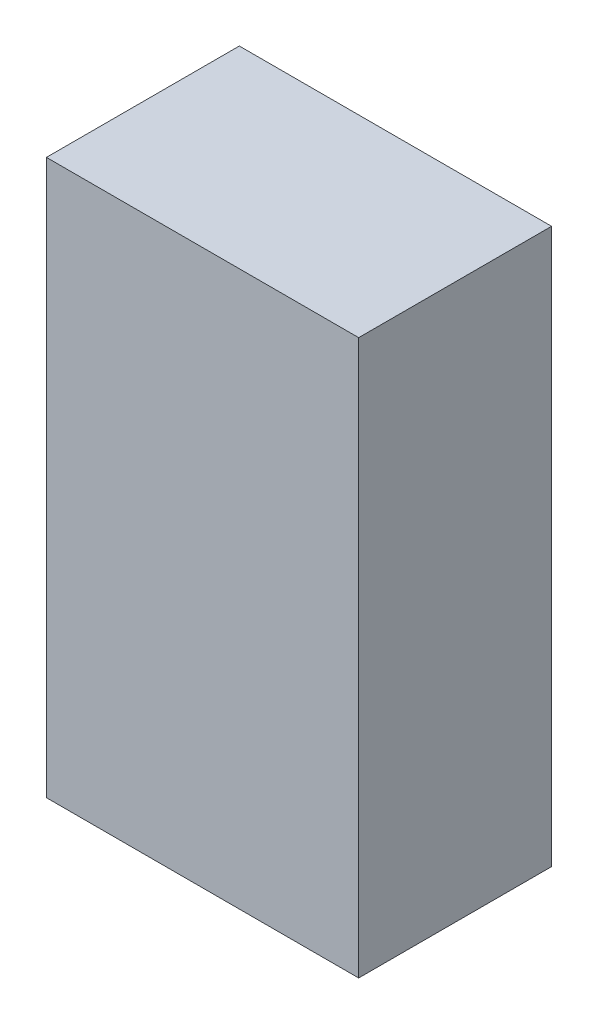
ISO-10303-21;
HEADER;
FILE_DESCRIPTION(('STEP AP214'),'2;1');
FILE_NAME('part.step','',(''),(''),'','','');
FILE_SCHEMA(('AUTOMOTIVE_DESIGN { 1 0 10303 214 1 1 1 1 }'));
ENDSEC;
DATA;
#1=APPLICATION_CONTEXT('core data for automotive mechanical design processes');
#2=APPLICATION_PROTOCOL_DEFINITION('international standard','automotive_design',2000,#1);
#3=PRODUCT_CONTEXT('',#1,'mechanical');
#4=PRODUCT('Part','Part','',(#3));
#5=PRODUCT_RELATED_PRODUCT_CATEGORY('part','',(#4));
#6=PRODUCT_DEFINITION_FORMATION('','',#4);
#7=PRODUCT_DEFINITION_CONTEXT('part definition',#1,'design');
#8=PRODUCT_DEFINITION('design','',#6,#7);
#9=PRODUCT_DEFINITION_SHAPE('','',#8);
#10=(LENGTH_UNIT() NAMED_UNIT(*) SI_UNIT(.MILLI.,.METRE.));
#11=(NAMED_UNIT(*) PLANE_ANGLE_UNIT() SI_UNIT($,.RADIAN.));
#12=(NAMED_UNIT(*) SI_UNIT($,.STERADIAN.) SOLID_ANGLE_UNIT());
#13=UNCERTAINTY_MEASURE_WITH_UNIT(LENGTH_MEASURE(1.E-05),#10,'distance_accuracy_value','');
#14=(GEOMETRIC_REPRESENTATION_CONTEXT(3) GLOBAL_UNCERTAINTY_ASSIGNED_CONTEXT((#13)) GLOBAL_UNIT_ASSIGNED_CONTEXT((#10,
#11,#12)) REPRESENTATION_CONTEXT('',''));
#15=CARTESIAN_POINT('',(0.,0.,0.));
#16=DIRECTION('',(0.,0.,1.));
#17=DIRECTION('',(1.,0.,0.));
#18=AXIS2_PLACEMENT_3D('',#15,#16,#17);
#19=CARTESIAN_POINT('',(-1.29499868,-2.30000048,1.59999934));
#20=DIRECTION('',(0.,0.,1.));
#21=DIRECTION('',(1.,0.,0.));
#22=AXIS2_PLACEMENT_3D('',#19,#20,#21);
#23=PLANE('',#22);
#24=DIRECTION('',(1.,0.,0.));
#25=VECTOR('',#24,1.);
#26=CARTESIAN_POINT('',(-1.29499868,2.30000048,1.59999934));
#27=LINE('',#26,#25);
#28=CARTESIAN_POINT('',(-1.29499868,2.30000048,1.59999934));
#29=VERTEX_POINT('',#28);
#30=CARTESIAN_POINT('',(1.29500122,2.30000048,1.59999934));
#31=VERTEX_POINT('',#30);
#32=EDGE_CURVE('E53',#29,#31,#27,.T.);
#33=ORIENTED_EDGE('',*,*,#32,.F.);
#34=DIRECTION('',(0.,1.,0.));
#35=VECTOR('',#34,1.);
#36=CARTESIAN_POINT('',(-1.29499868,-2.30000048,1.59999934));
#37=LINE('',#36,#35);
#38=CARTESIAN_POINT('',(-1.29499868,-2.30000048,1.59999934));
#39=VERTEX_POINT('',#38);
#40=EDGE_CURVE('E68',#39,#29,#37,.T.);
#41=ORIENTED_EDGE('',*,*,#40,.F.);
#42=DIRECTION('',(1.,0.,0.));
#43=VECTOR('',#42,1.);
#44=CARTESIAN_POINT('',(1.29500122,-2.30000048,1.59999934));
#45=LINE('',#44,#43);
#46=CARTESIAN_POINT('',(1.29500122,-2.30000048,1.59999934));
#47=VERTEX_POINT('',#46);
#48=EDGE_CURVE('E20',#47,#39,#45,.F.);
#49=ORIENTED_EDGE('',*,*,#48,.F.);
#50=DIRECTION('',(0.,1.,0.));
#51=VECTOR('',#50,1.);
#52=CARTESIAN_POINT('',(1.29500122,2.30000048,1.59999934));
#53=LINE('',#52,#51);
#54=EDGE_CURVE('E58',#31,#47,#53,.F.);
#55=ORIENTED_EDGE('',*,*,#54,.F.);
#56=EDGE_LOOP('',(#33,#41,#49,#55));
#57=FACE_BOUND('',#56,.T.);
#58=ADVANCED_FACE('F17',(#57),#23,.T.);
#59=CARTESIAN_POINT('',(1.29500122,-2.30000048,0.));
#60=DIRECTION('',(0.,-1.,0.));
#61=DIRECTION('',(0.,0.,-1.));
#62=AXIS2_PLACEMENT_3D('',#59,#60,#61);
#63=PLANE('',#62);
#64=DIRECTION('',(0.,0.,1.));
#65=VECTOR('',#64,1.);
#66=CARTESIAN_POINT('',(-1.29499868,-2.30000048,0.));
#67=LINE('',#66,#65);
#68=CARTESIAN_POINT('',(-1.29499868,-2.30000048,0.));
#69=VERTEX_POINT('',#68);
#70=EDGE_CURVE('E79',#69,#39,#67,.T.);
#71=ORIENTED_EDGE('',*,*,#70,.F.);
#72=DIRECTION('',(1.,0.,0.));
#73=VECTOR('',#72,1.);
#74=CARTESIAN_POINT('',(-1.29499868,-2.30000048,0.));
#75=LINE('',#74,#73);
#76=CARTESIAN_POINT('',(1.29500122,-2.30000048,0.));
#77=VERTEX_POINT('',#76);
#78=EDGE_CURVE('E74',#69,#77,#75,.T.);
#79=ORIENTED_EDGE('',*,*,#78,.T.);
#80=DIRECTION('',(0.,0.,-1.));
#81=VECTOR('',#80,1.);
#82=CARTESIAN_POINT('',(1.29500122,-2.30000048,0.));
#83=LINE('',#82,#81);
#84=EDGE_CURVE('E63',#47,#77,#83,.T.);
#85=ORIENTED_EDGE('',*,*,#84,.F.);
#86=ORIENTED_EDGE('',*,*,#48,.T.);
#87=EDGE_LOOP('',(#71,#79,#85,#86));
#88=FACE_BOUND('',#87,.T.);
#89=ADVANCED_FACE('F73',(#88),#63,.T.);
#90=CARTESIAN_POINT('',(1.29500122,2.30000048,0.));
#91=DIRECTION('',(1.,0.,0.));
#92=DIRECTION('',(0.,0.,-1.));
#93=AXIS2_PLACEMENT_3D('',#90,#91,#92);
#94=PLANE('',#93);
#95=ORIENTED_EDGE('',*,*,#84,.T.);
#96=DIRECTION('',(0.,1.,0.));
#97=VECTOR('',#96,1.);
#98=CARTESIAN_POINT('',(1.29500122,-2.30000048,0.));
#99=LINE('',#98,#97);
#100=CARTESIAN_POINT('',(1.29500122,2.30000048,0.));
#101=VERTEX_POINT('',#100);
#102=EDGE_CURVE('E84',#77,#101,#99,.T.);
#103=ORIENTED_EDGE('',*,*,#102,.T.);
#104=DIRECTION('',(0.,0.,1.));
#105=VECTOR('',#104,1.);
#106=CARTESIAN_POINT('',(1.29500122,2.30000048,0.));
#107=LINE('',#106,#105);
#108=EDGE_CURVE('E65',#31,#101,#107,.F.);
#109=ORIENTED_EDGE('',*,*,#108,.F.);
#110=ORIENTED_EDGE('',*,*,#54,.T.);
#111=EDGE_LOOP('',(#95,#103,#109,#110));
#112=FACE_BOUND('',#111,.T.);
#113=ADVANCED_FACE('F60',(#112),#94,.T.);
#114=CARTESIAN_POINT('',(-1.29499868,2.30000048,0.));
#115=DIRECTION('',(0.,1.,0.));
#116=DIRECTION('',(0.,0.,1.));
#117=AXIS2_PLACEMENT_3D('',#114,#115,#116);
#118=PLANE('',#117);
#119=ORIENTED_EDGE('',*,*,#108,.T.);
#120=DIRECTION('',(1.,0.,0.));
#121=VECTOR('',#120,1.);
#122=CARTESIAN_POINT('',(-1.29499868,2.30000048,0.));
#123=LINE('',#122,#121);
#124=CARTESIAN_POINT('',(-1.29499868,2.30000048,0.));
#125=VERTEX_POINT('',#124);
#126=EDGE_CURVE('E26',#101,#125,#123,.F.);
#127=ORIENTED_EDGE('',*,*,#126,.T.);
#128=DIRECTION('',(0.,0.,1.));
#129=VECTOR('',#128,1.);
#130=CARTESIAN_POINT('',(-1.29499868,2.30000048,0.));
#131=LINE('',#130,#129);
#132=EDGE_CURVE('E34',#29,#125,#131,.F.);
#133=ORIENTED_EDGE('',*,*,#132,.F.);
#134=ORIENTED_EDGE('',*,*,#32,.T.);
#135=EDGE_LOOP('',(#119,#127,#133,#134));
#136=FACE_BOUND('',#135,.T.);
#137=ADVANCED_FACE('F88',(#136),#118,.T.);
#138=CARTESIAN_POINT('',(-1.29499868,-2.30000048,0.));
#139=DIRECTION('',(-1.,0.,0.));
#140=DIRECTION('',(0.,0.,1.));
#141=AXIS2_PLACEMENT_3D('',#138,#139,#140);
#142=PLANE('',#141);
#143=ORIENTED_EDGE('',*,*,#132,.T.);
#144=DIRECTION('',(0.,1.,0.));
#145=VECTOR('',#144,1.);
#146=CARTESIAN_POINT('',(-1.29499868,-2.30000048,0.));
#147=LINE('',#146,#145);
#148=EDGE_CURVE('E11',#125,#69,#147,.F.);
#149=ORIENTED_EDGE('',*,*,#148,.T.);
#150=ORIENTED_EDGE('',*,*,#70,.T.);
#151=ORIENTED_EDGE('',*,*,#40,.T.);
#152=EDGE_LOOP('',(#143,#149,#150,#151));
#153=FACE_BOUND('',#152,.T.);
#154=ADVANCED_FACE('F91',(#153),#142,.T.);
#155=CARTESIAN_POINT('',(-1.29499868,-2.30000048,0.));
#156=DIRECTION('',(0.,0.,1.));
#157=DIRECTION('',(1.,0.,0.));
#158=AXIS2_PLACEMENT_3D('',#155,#156,#157);
#159=PLANE('',#158);
#160=ORIENTED_EDGE('',*,*,#126,.F.);
#161=ORIENTED_EDGE('',*,*,#102,.F.);
#162=ORIENTED_EDGE('',*,*,#78,.F.);
#163=ORIENTED_EDGE('',*,*,#148,.F.);
#164=EDGE_LOOP('',(#160,#161,#162,#163));
#165=FACE_BOUND('',#164,.T.);
#166=ADVANCED_FACE('F90',(#165),#159,.F.);
#167=CLOSED_SHELL('',(#58,#89,#113,#137,#154,#166));
#168=MANIFOLD_SOLID_BREP('B1',#167);
#169=ADVANCED_BREP_SHAPE_REPRESENTATION('',(#18,#168),#14);
#170=SHAPE_DEFINITION_REPRESENTATION(#9,#169);
ENDSEC;
END-ISO-10303-21;
